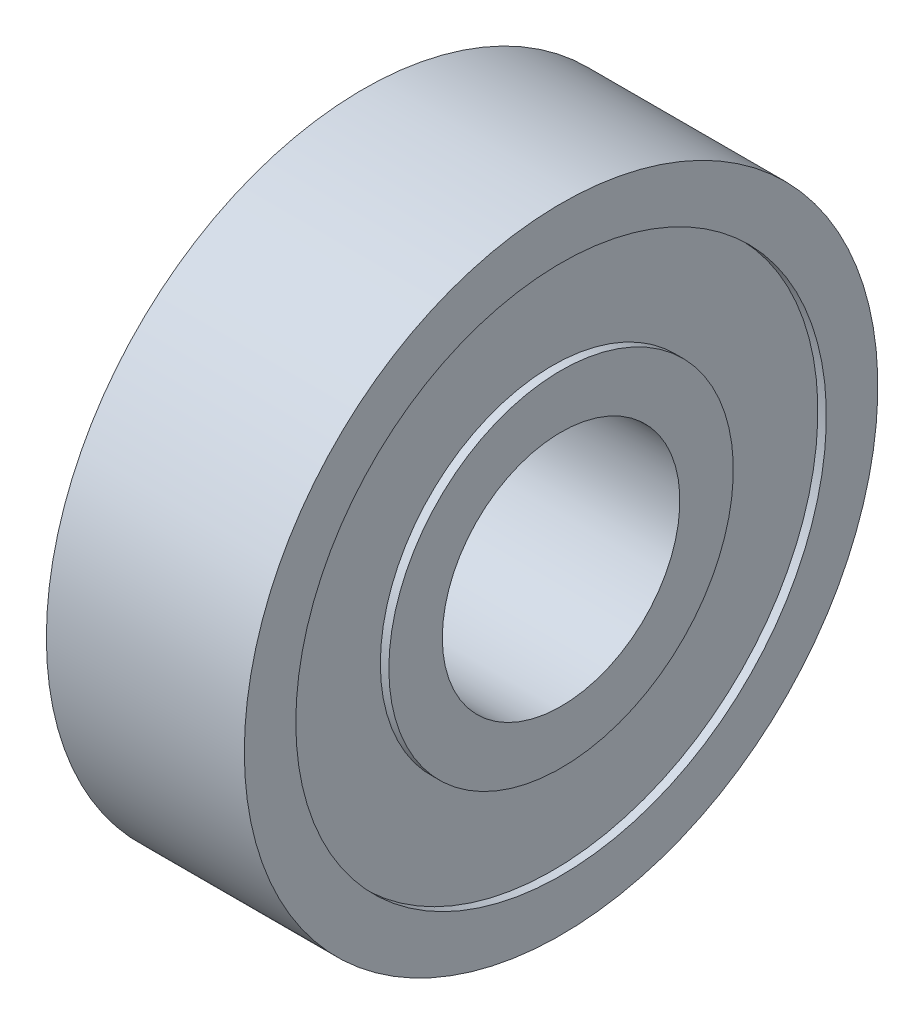
ISO-10303-21;
HEADER;
FILE_DESCRIPTION(('STEP AP214'),'2;1');
FILE_NAME('part.step','',(''),(''),'','','');
FILE_SCHEMA(('AUTOMOTIVE_DESIGN { 1 0 10303 214 1 1 1 1 }'));
ENDSEC;
DATA;
#1=APPLICATION_CONTEXT('core data for automotive mechanical design processes');
#2=APPLICATION_PROTOCOL_DEFINITION('international standard','automotive_design',2000,#1);
#3=PRODUCT_CONTEXT('',#1,'mechanical');
#4=PRODUCT('Part','Part','',(#3));
#5=PRODUCT_RELATED_PRODUCT_CATEGORY('part','',(#4));
#6=PRODUCT_DEFINITION_FORMATION('','',#4);
#7=PRODUCT_DEFINITION_CONTEXT('part definition',#1,'design');
#8=PRODUCT_DEFINITION('design','',#6,#7);
#9=PRODUCT_DEFINITION_SHAPE('','',#8);
#10=(LENGTH_UNIT() NAMED_UNIT(*) SI_UNIT(.MILLI.,.METRE.));
#11=(NAMED_UNIT(*) PLANE_ANGLE_UNIT() SI_UNIT($,.RADIAN.));
#12=(NAMED_UNIT(*) SI_UNIT($,.STERADIAN.) SOLID_ANGLE_UNIT());
#13=UNCERTAINTY_MEASURE_WITH_UNIT(LENGTH_MEASURE(1.E-05),#10,'distance_accuracy_value','');
#14=(GEOMETRIC_REPRESENTATION_CONTEXT(3) GLOBAL_UNCERTAINTY_ASSIGNED_CONTEXT((#13)) GLOBAL_UNIT_ASSIGNED_CONTEXT((#10,
#11,#12)) REPRESENTATION_CONTEXT('',''));
#15=CARTESIAN_POINT('',(0.,0.,0.));
#16=DIRECTION('',(0.,0.,1.));
#17=DIRECTION('',(1.,0.,0.));
#18=AXIS2_PLACEMENT_3D('',#15,#16,#17);
#19=CARTESIAN_POINT('',(0.,16.,0.));
#20=DIRECTION('',(1.,0.,0.));
#21=DIRECTION('',(0.,0.,-1.));
#22=AXIS2_PLACEMENT_3D('',#19,#20,#21);
#23=PLANE('',#22);
#24=CARTESIAN_POINT('',(0.,0.,0.));
#25=DIRECTION('',(-1.,0.,0.));
#26=DIRECTION('',(0.,0.,1.));
#27=AXIS2_PLACEMENT_3D('',#24,#25,#26);
#28=CIRCLE('',#27,13.4);
#29=CARTESIAN_POINT('',(0.,0.,13.4));
#30=VERTEX_POINT('',#29);
#31=EDGE_CURVE('E10',#30,#30,#28,.T.);
#32=ORIENTED_EDGE('',*,*,#31,.F.);
#33=EDGE_LOOP('',(#32));
#34=FACE_BOUND('',#33,.T.);
#35=CARTESIAN_POINT('',(0.,0.,0.));
#36=DIRECTION('',(-1.,0.,0.));
#37=DIRECTION('',(0.,0.,1.));
#38=AXIS2_PLACEMENT_3D('',#35,#36,#37);
#39=CIRCLE('',#38,16.);
#40=CARTESIAN_POINT('',(0.,0.,16.));
#41=VERTEX_POINT('',#40);
#42=EDGE_CURVE('E71',#41,#41,#39,.T.);
#43=ORIENTED_EDGE('',*,*,#42,.T.);
#44=EDGE_LOOP('',(#43));
#45=FACE_BOUND('',#44,.T.);
#46=ADVANCED_FACE('F31',(#34,#45),#23,.F.);
#47=CARTESIAN_POINT('',(50.,0.,0.));
#48=DIRECTION('',(-1.,0.,0.));
#49=DIRECTION('',(0.,0.,1.));
#50=AXIS2_PLACEMENT_3D('',#47,#48,#49);
#51=CYLINDRICAL_SURFACE('',#50,13.4);
#52=CARTESIAN_POINT('',(0.43,0.,0.));
#53=DIRECTION('',(-1.,0.,0.));
#54=DIRECTION('',(0.,0.,1.));
#55=AXIS2_PLACEMENT_3D('',#52,#53,#54);
#56=CIRCLE('',#55,13.4);
#57=CARTESIAN_POINT('',(0.43,0.,13.4));
#58=VERTEX_POINT('',#57);
#59=EDGE_CURVE('E37',#58,#58,#56,.T.);
#60=ORIENTED_EDGE('',*,*,#59,.F.);
#61=EDGE_LOOP('',(#60));
#62=FACE_BOUND('',#61,.T.);
#63=ORIENTED_EDGE('',*,*,#31,.T.);
#64=EDGE_LOOP('',(#63));
#65=FACE_BOUND('',#64,.T.);
#66=ADVANCED_FACE('F132',(#62,#65),#51,.F.);
#67=CARTESIAN_POINT('',(0.43,13.4,0.));
#68=DIRECTION('',(1.,0.,0.));
#69=DIRECTION('',(0.,0.,-1.));
#70=AXIS2_PLACEMENT_3D('',#67,#68,#69);
#71=PLANE('',#70);
#72=CARTESIAN_POINT('',(0.43,0.,0.));
#73=DIRECTION('',(-1.,0.,0.));
#74=DIRECTION('',(0.,0.,1.));
#75=AXIS2_PLACEMENT_3D('',#72,#73,#74);
#76=CIRCLE('',#75,8.7);
#77=CARTESIAN_POINT('',(0.43,0.,8.7));
#78=VERTEX_POINT('',#77);
#79=EDGE_CURVE('E41',#78,#78,#76,.T.);
#80=ORIENTED_EDGE('',*,*,#79,.F.);
#81=EDGE_LOOP('',(#80));
#82=FACE_BOUND('',#81,.T.);
#83=ORIENTED_EDGE('',*,*,#59,.T.);
#84=EDGE_LOOP('',(#83));
#85=FACE_BOUND('',#84,.T.);
#86=ADVANCED_FACE('F127',(#82,#85),#71,.F.);
#87=CARTESIAN_POINT('',(50.,0.,0.));
#88=DIRECTION('',(-1.,0.,0.));
#89=DIRECTION('',(0.,0.,1.));
#90=AXIS2_PLACEMENT_3D('',#87,#88,#89);
#91=CYLINDRICAL_SURFACE('',#90,8.7);
#92=CARTESIAN_POINT('',(0.,0.,0.));
#93=DIRECTION('',(-1.,0.,0.));
#94=DIRECTION('',(0.,0.,1.));
#95=AXIS2_PLACEMENT_3D('',#92,#93,#94);
#96=CIRCLE('',#95,8.7);
#97=CARTESIAN_POINT('',(0.,0.,8.7));
#98=VERTEX_POINT('',#97);
#99=EDGE_CURVE('E45',#98,#98,#96,.T.);
#100=ORIENTED_EDGE('',*,*,#99,.F.);
#101=EDGE_LOOP('',(#100));
#102=FACE_BOUND('',#101,.T.);
#103=ORIENTED_EDGE('',*,*,#79,.T.);
#104=EDGE_LOOP('',(#103));
#105=FACE_BOUND('',#104,.T.);
#106=ADVANCED_FACE('F121',(#102,#105),#91,.T.);
#107=CARTESIAN_POINT('',(0.,8.7,0.));
#108=DIRECTION('',(1.,0.,0.));
#109=DIRECTION('',(0.,0.,-1.));
#110=AXIS2_PLACEMENT_3D('',#107,#108,#109);
#111=PLANE('',#110);
#112=CARTESIAN_POINT('',(0.,0.,0.));
#113=DIRECTION('',(-1.,0.,0.));
#114=DIRECTION('',(0.,0.,1.));
#115=AXIS2_PLACEMENT_3D('',#112,#113,#114);
#116=CIRCLE('',#115,6.);
#117=CARTESIAN_POINT('',(0.,0.,6.));
#118=VERTEX_POINT('',#117);
#119=EDGE_CURVE('E50',#118,#118,#116,.T.);
#120=ORIENTED_EDGE('',*,*,#119,.F.);
#121=EDGE_LOOP('',(#120));
#122=FACE_BOUND('',#121,.T.);
#123=ORIENTED_EDGE('',*,*,#99,.T.);
#124=EDGE_LOOP('',(#123));
#125=FACE_BOUND('',#124,.T.);
#126=ADVANCED_FACE('F115',(#122,#125),#111,.F.);
#127=CARTESIAN_POINT('',(50.,0.,0.));
#128=DIRECTION('',(-1.,0.,0.));
#129=DIRECTION('',(0.,0.,1.));
#130=AXIS2_PLACEMENT_3D('',#127,#128,#129);
#131=CYLINDRICAL_SURFACE('',#130,6.);
#132=CARTESIAN_POINT('',(10.,0.,0.));
#133=DIRECTION('',(-1.,0.,0.));
#134=DIRECTION('',(0.,0.,1.));
#135=AXIS2_PLACEMENT_3D('',#132,#133,#134);
#136=CIRCLE('',#135,6.);
#137=CARTESIAN_POINT('',(10.,0.,6.));
#138=VERTEX_POINT('',#137);
#139=EDGE_CURVE('E53',#138,#138,#136,.T.);
#140=ORIENTED_EDGE('',*,*,#139,.F.);
#141=EDGE_LOOP('',(#140));
#142=FACE_BOUND('',#141,.T.);
#143=ORIENTED_EDGE('',*,*,#119,.T.);
#144=EDGE_LOOP('',(#143));
#145=FACE_BOUND('',#144,.T.);
#146=ADVANCED_FACE('F109',(#142,#145),#131,.F.);
#147=CARTESIAN_POINT('',(10.,6.,0.));
#148=DIRECTION('',(-1.,0.,0.));
#149=DIRECTION('',(0.,0.,1.));
#150=AXIS2_PLACEMENT_3D('',#147,#148,#149);
#151=PLANE('',#150);
#152=CARTESIAN_POINT('',(10.,0.,0.));
#153=DIRECTION('',(-1.,0.,0.));
#154=DIRECTION('',(0.,0.,1.));
#155=AXIS2_PLACEMENT_3D('',#152,#153,#154);
#156=CIRCLE('',#155,8.7);
#157=CARTESIAN_POINT('',(10.,0.,8.7));
#158=VERTEX_POINT('',#157);
#159=EDGE_CURVE('E56',#158,#158,#156,.T.);
#160=ORIENTED_EDGE('',*,*,#159,.F.);
#161=EDGE_LOOP('',(#160));
#162=FACE_BOUND('',#161,.T.);
#163=ORIENTED_EDGE('',*,*,#139,.T.);
#164=EDGE_LOOP('',(#163));
#165=FACE_BOUND('',#164,.T.);
#166=ADVANCED_FACE('F103',(#162,#165),#151,.F.);
#167=CARTESIAN_POINT('',(50.,0.,0.));
#168=DIRECTION('',(-1.,0.,0.));
#169=DIRECTION('',(0.,0.,1.));
#170=AXIS2_PLACEMENT_3D('',#167,#168,#169);
#171=CYLINDRICAL_SURFACE('',#170,8.7);
#172=CARTESIAN_POINT('',(9.57,0.,0.));
#173=DIRECTION('',(-1.,0.,0.));
#174=DIRECTION('',(0.,0.,1.));
#175=AXIS2_PLACEMENT_3D('',#172,#173,#174);
#176=CIRCLE('',#175,8.7);
#177=CARTESIAN_POINT('',(9.57,0.,8.7));
#178=VERTEX_POINT('',#177);
#179=EDGE_CURVE('E59',#178,#178,#176,.T.);
#180=ORIENTED_EDGE('',*,*,#179,.F.);
#181=EDGE_LOOP('',(#180));
#182=FACE_BOUND('',#181,.T.);
#183=ORIENTED_EDGE('',*,*,#159,.T.);
#184=EDGE_LOOP('',(#183));
#185=FACE_BOUND('',#184,.T.);
#186=ADVANCED_FACE('F97',(#182,#185),#171,.T.);
#187=CARTESIAN_POINT('',(9.57,8.7,0.));
#188=DIRECTION('',(-1.,0.,0.));
#189=DIRECTION('',(0.,0.,1.));
#190=AXIS2_PLACEMENT_3D('',#187,#188,#189);
#191=PLANE('',#190);
#192=CARTESIAN_POINT('',(9.57,0.,0.));
#193=DIRECTION('',(-1.,0.,0.));
#194=DIRECTION('',(0.,0.,1.));
#195=AXIS2_PLACEMENT_3D('',#192,#193,#194);
#196=CIRCLE('',#195,13.4);
#197=CARTESIAN_POINT('',(9.57,0.,13.4));
#198=VERTEX_POINT('',#197);
#199=EDGE_CURVE('E62',#198,#198,#196,.T.);
#200=ORIENTED_EDGE('',*,*,#199,.F.);
#201=EDGE_LOOP('',(#200));
#202=FACE_BOUND('',#201,.T.);
#203=ORIENTED_EDGE('',*,*,#179,.T.);
#204=EDGE_LOOP('',(#203));
#205=FACE_BOUND('',#204,.T.);
#206=ADVANCED_FACE('F91',(#202,#205),#191,.F.);
#207=CARTESIAN_POINT('',(50.,0.,0.));
#208=DIRECTION('',(-1.,0.,0.));
#209=DIRECTION('',(0.,0.,1.));
#210=AXIS2_PLACEMENT_3D('',#207,#208,#209);
#211=CYLINDRICAL_SURFACE('',#210,13.4);
#212=CARTESIAN_POINT('',(10.,0.,0.));
#213=DIRECTION('',(-1.,0.,0.));
#214=DIRECTION('',(0.,0.,1.));
#215=AXIS2_PLACEMENT_3D('',#212,#213,#214);
#216=CIRCLE('',#215,13.4);
#217=CARTESIAN_POINT('',(10.,0.,13.4));
#218=VERTEX_POINT('',#217);
#219=EDGE_CURVE('E65',#218,#218,#216,.T.);
#220=ORIENTED_EDGE('',*,*,#219,.F.);
#221=EDGE_LOOP('',(#220));
#222=FACE_BOUND('',#221,.T.);
#223=ORIENTED_EDGE('',*,*,#199,.T.);
#224=EDGE_LOOP('',(#223));
#225=FACE_BOUND('',#224,.T.);
#226=ADVANCED_FACE('F85',(#222,#225),#211,.F.);
#227=CARTESIAN_POINT('',(10.,13.4,0.));
#228=DIRECTION('',(-1.,0.,0.));
#229=DIRECTION('',(0.,0.,1.));
#230=AXIS2_PLACEMENT_3D('',#227,#228,#229);
#231=PLANE('',#230);
#232=CARTESIAN_POINT('',(10.,0.,0.));
#233=DIRECTION('',(-1.,0.,0.));
#234=DIRECTION('',(0.,0.,1.));
#235=AXIS2_PLACEMENT_3D('',#232,#233,#234);
#236=CIRCLE('',#235,16.);
#237=CARTESIAN_POINT('',(10.,0.,16.));
#238=VERTEX_POINT('',#237);
#239=EDGE_CURVE('E68',#238,#238,#236,.T.);
#240=ORIENTED_EDGE('',*,*,#239,.F.);
#241=EDGE_LOOP('',(#240));
#242=FACE_BOUND('',#241,.T.);
#243=ORIENTED_EDGE('',*,*,#219,.T.);
#244=EDGE_LOOP('',(#243));
#245=FACE_BOUND('',#244,.T.);
#246=ADVANCED_FACE('F79',(#242,#245),#231,.F.);
#247=CARTESIAN_POINT('',(50.,0.,0.));
#248=DIRECTION('',(-1.,0.,0.));
#249=DIRECTION('',(0.,0.,1.));
#250=AXIS2_PLACEMENT_3D('',#247,#248,#249);
#251=CYLINDRICAL_SURFACE('',#250,16.);
#252=ORIENTED_EDGE('',*,*,#42,.F.);
#253=EDGE_LOOP('',(#252));
#254=FACE_BOUND('',#253,.T.);
#255=ORIENTED_EDGE('',*,*,#239,.T.);
#256=EDGE_LOOP('',(#255));
#257=FACE_BOUND('',#256,.T.);
#258=ADVANCED_FACE('F76',(#254,#257),#251,.T.);
#259=CLOSED_SHELL('',(#46,#66,#86,#106,#126,#146,#166,#186,#206,#226,#246,#258));
#260=MANIFOLD_SOLID_BREP('B2',#259);
#261=ADVANCED_BREP_SHAPE_REPRESENTATION('',(#18,#260),#14);
#262=SHAPE_DEFINITION_REPRESENTATION(#9,#261);
ENDSEC;
END-ISO-10303-21;
